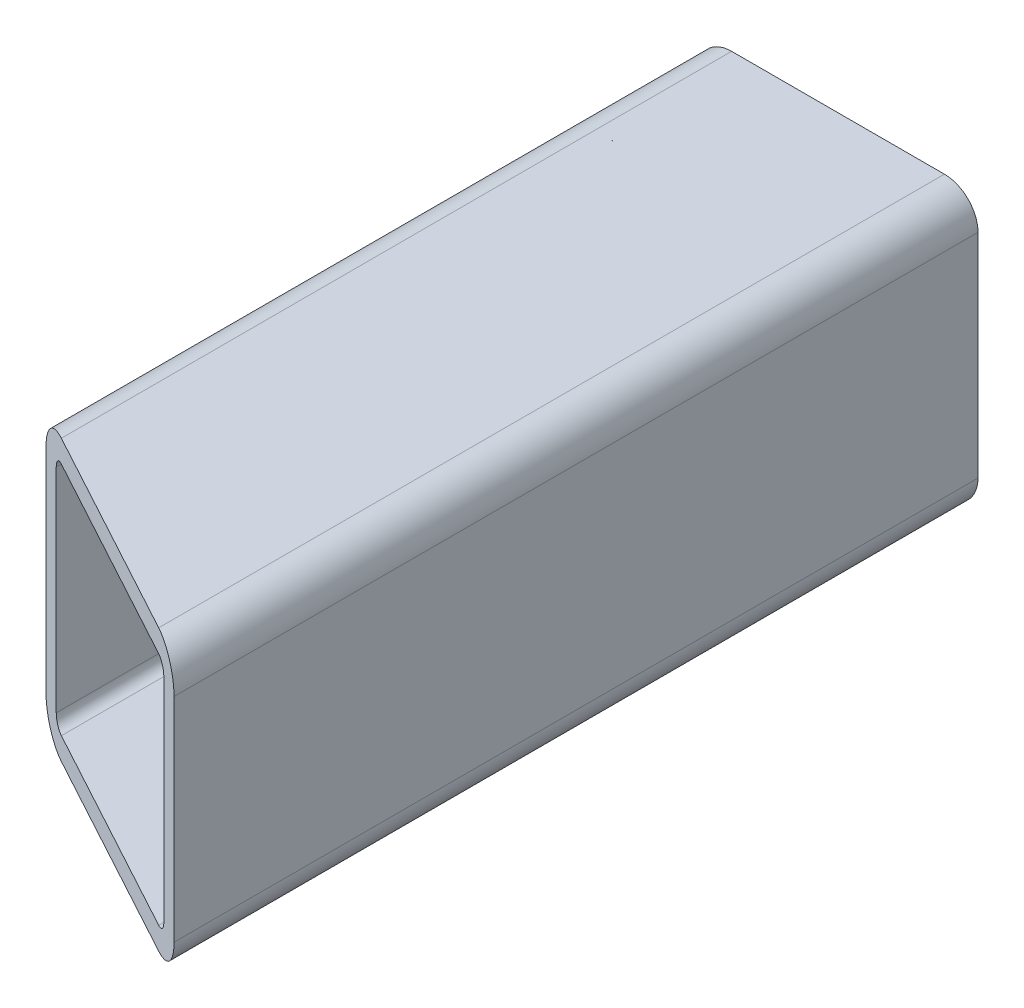
ISO-10303-21;
HEADER;
FILE_DESCRIPTION(('STEP AP214'),'2;1');
FILE_NAME('part.step','',(''),(''),'','','');
FILE_SCHEMA(('AUTOMOTIVE_DESIGN { 1 0 10303 214 1 1 1 1 }'));
ENDSEC;
DATA;
#1=APPLICATION_CONTEXT('core data for automotive mechanical design processes');
#2=APPLICATION_PROTOCOL_DEFINITION('international standard','automotive_design',2000,#1);
#3=PRODUCT_CONTEXT('',#1,'mechanical');
#4=PRODUCT('Part','Part','',(#3));
#5=PRODUCT_RELATED_PRODUCT_CATEGORY('part','',(#4));
#6=PRODUCT_DEFINITION_FORMATION('','',#4);
#7=PRODUCT_DEFINITION_CONTEXT('part definition',#1,'design');
#8=PRODUCT_DEFINITION('design','',#6,#7);
#9=PRODUCT_DEFINITION_SHAPE('','',#8);
#10=(LENGTH_UNIT() NAMED_UNIT(*) SI_UNIT(.MILLI.,.METRE.));
#11=(NAMED_UNIT(*) PLANE_ANGLE_UNIT() SI_UNIT($,.RADIAN.));
#12=(NAMED_UNIT(*) SI_UNIT($,.STERADIAN.) SOLID_ANGLE_UNIT());
#13=UNCERTAINTY_MEASURE_WITH_UNIT(LENGTH_MEASURE(1.E-05),#10,'distance_accuracy_value','');
#14=(GEOMETRIC_REPRESENTATION_CONTEXT(3) GLOBAL_UNCERTAINTY_ASSIGNED_CONTEXT((#13)) GLOBAL_UNIT_ASSIGNED_CONTEXT((#10,
#11,#12)) REPRESENTATION_CONTEXT('',''));
#15=CARTESIAN_POINT('',(0.,0.,0.));
#16=DIRECTION('',(0.,0.,1.));
#17=DIRECTION('',(1.,0.,0.));
#18=AXIS2_PLACEMENT_3D('',#15,#16,#17);
#19=CARTESIAN_POINT('',(0.,0.,0.));
#20=DIRECTION('',(0.,0.,1.));
#21=DIRECTION('',(1.,0.,0.));
#22=AXIS2_PLACEMENT_3D('',#19,#20,#21);
#23=PLANE('',#22);
#24=DIRECTION('',(0.,1.,0.));
#25=VECTOR('',#24,1.);
#26=CARTESIAN_POINT('',(-12.5,-4.75,0.));
#27=LINE('',#26,#25);
#28=CARTESIAN_POINT('',(-12.5,-9.5,0.));
#29=VERTEX_POINT('',#28);
#30=CARTESIAN_POINT('',(-12.5,9.5,0.));
#31=VERTEX_POINT('',#30);
#32=EDGE_CURVE('E11',#29,#31,#27,.T.);
#33=ORIENTED_EDGE('',*,*,#32,.T.);
#34=CARTESIAN_POINT('',(-9.5,9.5,0.));
#35=DIRECTION('',(0.,0.,-1.));
#36=DIRECTION('',(0.,-1.,0.));
#37=AXIS2_PLACEMENT_3D('',#34,#35,#36);
#38=CIRCLE('',#37,3.);
#39=CARTESIAN_POINT('',(-9.5,12.5,0.));
#40=VERTEX_POINT('',#39);
#41=EDGE_CURVE('E245',#31,#40,#38,.T.);
#42=ORIENTED_EDGE('',*,*,#41,.T.);
#43=DIRECTION('',(1.,0.,0.));
#44=VECTOR('',#43,1.);
#45=CARTESIAN_POINT('',(-4.75,12.5,0.));
#46=LINE('',#45,#44);
#47=CARTESIAN_POINT('',(9.5,12.5,0.));
#48=VERTEX_POINT('',#47);
#49=EDGE_CURVE('E162',#40,#48,#46,.T.);
#50=ORIENTED_EDGE('',*,*,#49,.T.);
#51=CARTESIAN_POINT('',(9.5,9.5,0.));
#52=DIRECTION('',(0.,0.,-1.));
#53=DIRECTION('',(-1.,0.,0.));
#54=AXIS2_PLACEMENT_3D('',#51,#52,#53);
#55=CIRCLE('',#54,3.);
#56=CARTESIAN_POINT('',(12.5,9.5,0.));
#57=VERTEX_POINT('',#56);
#58=EDGE_CURVE('E159',#48,#57,#55,.T.);
#59=ORIENTED_EDGE('',*,*,#58,.T.);
#60=DIRECTION('',(0.,-1.,0.));
#61=VECTOR('',#60,1.);
#62=CARTESIAN_POINT('',(12.5,4.75,0.));
#63=LINE('',#62,#61);
#64=CARTESIAN_POINT('',(12.5,-9.5,0.));
#65=VERTEX_POINT('',#64);
#66=EDGE_CURVE('E146',#57,#65,#63,.T.);
#67=ORIENTED_EDGE('',*,*,#66,.T.);
#68=CARTESIAN_POINT('',(9.5,-9.5,0.));
#69=DIRECTION('',(0.,0.,-1.));
#70=DIRECTION('',(0.,1.,0.));
#71=AXIS2_PLACEMENT_3D('',#68,#69,#70);
#72=CIRCLE('',#71,3.);
#73=CARTESIAN_POINT('',(9.5,-12.5,0.));
#74=VERTEX_POINT('',#73);
#75=EDGE_CURVE('E235',#65,#74,#72,.T.);
#76=ORIENTED_EDGE('',*,*,#75,.T.);
#77=DIRECTION('',(-1.,0.,0.));
#78=VECTOR('',#77,1.);
#79=CARTESIAN_POINT('',(4.75,-12.5,0.));
#80=LINE('',#79,#78);
#81=CARTESIAN_POINT('',(-9.5,-12.5,0.));
#82=VERTEX_POINT('',#81);
#83=EDGE_CURVE('E234',#74,#82,#80,.T.);
#84=ORIENTED_EDGE('',*,*,#83,.T.);
#85=CARTESIAN_POINT('',(-9.5,-9.5,0.));
#86=DIRECTION('',(0.,0.,-1.));
#87=DIRECTION('',(1.,0.,0.));
#88=AXIS2_PLACEMENT_3D('',#85,#86,#87);
#89=CIRCLE('',#88,3.);
#90=EDGE_CURVE('E26',#82,#29,#89,.T.);
#91=ORIENTED_EDGE('',*,*,#90,.T.);
#92=EDGE_LOOP('',(#33,#42,#50,#59,#67,#76,#84,#91));
#93=FACE_BOUND('',#92,.T.);
#94=DIRECTION('',(-1.,0.,0.));
#95=VECTOR('',#94,1.);
#96=CARTESIAN_POINT('',(-4.75,10.5,0.));
#97=LINE('',#96,#95);
#98=CARTESIAN_POINT('',(9.5,10.5,0.));
#99=VERTEX_POINT('',#98);
#100=CARTESIAN_POINT('',(-9.5,10.5,0.));
#101=VERTEX_POINT('',#100);
#102=EDGE_CURVE('E187',#99,#101,#97,.T.);
#103=ORIENTED_EDGE('',*,*,#102,.T.);
#104=CARTESIAN_POINT('',(-9.5,9.5,0.));
#105=DIRECTION('',(0.,0.,1.));
#106=DIRECTION('',(0.,-1.,0.));
#107=AXIS2_PLACEMENT_3D('',#104,#105,#106);
#108=CIRCLE('',#107,1.);
#109=CARTESIAN_POINT('',(-10.5,9.5,0.));
#110=VERTEX_POINT('',#109);
#111=EDGE_CURVE('E197',#101,#110,#108,.T.);
#112=ORIENTED_EDGE('',*,*,#111,.T.);
#113=DIRECTION('',(0.,-1.,0.));
#114=VECTOR('',#113,1.);
#115=CARTESIAN_POINT('',(-10.5,-4.75,0.));
#116=LINE('',#115,#114);
#117=CARTESIAN_POINT('',(-10.5,-9.5,0.));
#118=VERTEX_POINT('',#117);
#119=EDGE_CURVE('E288',#110,#118,#116,.T.);
#120=ORIENTED_EDGE('',*,*,#119,.T.);
#121=CARTESIAN_POINT('',(-9.5,-9.5,0.));
#122=DIRECTION('',(0.,0.,1.));
#123=DIRECTION('',(1.,0.,0.));
#124=AXIS2_PLACEMENT_3D('',#121,#122,#123);
#125=CIRCLE('',#124,1.);
#126=CARTESIAN_POINT('',(-9.5,-10.5,0.));
#127=VERTEX_POINT('',#126);
#128=EDGE_CURVE('E277',#118,#127,#125,.T.);
#129=ORIENTED_EDGE('',*,*,#128,.T.);
#130=DIRECTION('',(1.,0.,0.));
#131=VECTOR('',#130,1.);
#132=CARTESIAN_POINT('',(4.75,-10.5,0.));
#133=LINE('',#132,#131);
#134=CARTESIAN_POINT('',(9.5,-10.5,0.));
#135=VERTEX_POINT('',#134);
#136=EDGE_CURVE('E216',#127,#135,#133,.T.);
#137=ORIENTED_EDGE('',*,*,#136,.T.);
#138=CARTESIAN_POINT('',(9.5,-9.5,0.));
#139=DIRECTION('',(0.,0.,1.));
#140=DIRECTION('',(0.,1.,0.));
#141=AXIS2_PLACEMENT_3D('',#138,#139,#140);
#142=CIRCLE('',#141,1.);
#143=CARTESIAN_POINT('',(10.5,-9.5,0.));
#144=VERTEX_POINT('',#143);
#145=EDGE_CURVE('E289',#135,#144,#142,.T.);
#146=ORIENTED_EDGE('',*,*,#145,.T.);
#147=DIRECTION('',(0.,1.,0.));
#148=VECTOR('',#147,1.);
#149=CARTESIAN_POINT('',(10.5,4.75,0.));
#150=LINE('',#149,#148);
#151=CARTESIAN_POINT('',(10.5,9.5,0.));
#152=VERTEX_POINT('',#151);
#153=EDGE_CURVE('E203',#144,#152,#150,.T.);
#154=ORIENTED_EDGE('',*,*,#153,.T.);
#155=CARTESIAN_POINT('',(9.5,9.5,0.));
#156=DIRECTION('',(0.,0.,1.));
#157=DIRECTION('',(-1.,0.,0.));
#158=AXIS2_PLACEMENT_3D('',#155,#156,#157);
#159=CIRCLE('',#158,1.);
#160=EDGE_CURVE('E207',#152,#99,#159,.T.);
#161=ORIENTED_EDGE('',*,*,#160,.T.);
#162=EDGE_LOOP('',(#103,#112,#120,#129,#137,#146,#154,#161));
#163=FACE_BOUND('',#162,.T.);
#164=ADVANCED_FACE('F16',(#93,#163),#23,.F.);
#165=CARTESIAN_POINT('',(-12.5,-9.5,0.));
#166=DIRECTION('',(-1.,0.,0.));
#167=DIRECTION('',(0.,1.,0.));
#168=AXIS2_PLACEMENT_3D('',#165,#166,#167);
#169=PLANE('',#168);
#170=DIRECTION('',(0.,1.,-1.00427515727228E-07));
#171=VECTOR('',#170,1.);
#172=CARTESIAN_POINT('',(-12.5,-4.74999415349802,58.2161367223961));
#173=LINE('',#172,#171);
#174=CARTESIAN_POINT('',(-12.5,-9.5,58.2161371994274));
#175=VERTEX_POINT('',#174);
#176=CARTESIAN_POINT('',(-12.5,9.5,58.2161352913046));
#177=VERTEX_POINT('',#176);
#178=EDGE_CURVE('E239',#175,#177,#173,.T.);
#179=ORIENTED_EDGE('',*,*,#178,.T.);
#180=DIRECTION('',(0.,0.,1.));
#181=VECTOR('',#180,1.);
#182=CARTESIAN_POINT('',(-12.5,9.5,0.));
#183=LINE('',#182,#181);
#184=EDGE_CURVE('E213',#31,#177,#183,.T.);
#185=ORIENTED_EDGE('',*,*,#184,.F.);
#186=ORIENTED_EDGE('',*,*,#32,.F.);
#187=DIRECTION('',(0.,0.,1.));
#188=VECTOR('',#187,1.);
#189=CARTESIAN_POINT('',(-12.5,-9.5,0.));
#190=LINE('',#189,#188);
#191=EDGE_CURVE('E267',#29,#175,#190,.T.);
#192=ORIENTED_EDGE('',*,*,#191,.T.);
#193=EDGE_LOOP('',(#179,#185,#186,#192));
#194=FACE_BOUND('',#193,.T.);
#195=ADVANCED_FACE('F421',(#194),#169,.T.);
#196=CARTESIAN_POINT('',(-9.5,-9.5,0.));
#197=DIRECTION('',(0.,0.,1.));
#198=DIRECTION('',(1.,0.,0.));
#199=AXIS2_PLACEMENT_3D('',#196,#197,#198);
#200=CYLINDRICAL_SURFACE('',#199,3.);
#201=CARTESIAN_POINT('',(-9.5,-9.5,59.8442645005396));
#202=DIRECTION('',(0.476991360566237,-8.82665451376979E-08,-0.878907982638207));
#203=DIRECTION('',(0.87890798263821,0.,0.476991360566239));
#204=AXIS2_PLACEMENT_3D('',#201,#202,#203);
#205=ELLIPSE('',#204,3.41332660444718,3.);
#206=CARTESIAN_POINT('',(-9.5,-12.5,59.8442648018221));
#207=VERTEX_POINT('',#206);
#208=EDGE_CURVE('E242',#207,#175,#205,.T.);
#209=ORIENTED_EDGE('',*,*,#208,.T.);
#210=ORIENTED_EDGE('',*,*,#191,.F.);
#211=ORIENTED_EDGE('',*,*,#90,.F.);
#212=DIRECTION('',(0.,0.,1.));
#213=VECTOR('',#212,1.);
#214=CARTESIAN_POINT('',(-9.5,-12.5,0.));
#215=LINE('',#214,#213);
#216=EDGE_CURVE('E78',#82,#207,#215,.T.);
#217=ORIENTED_EDGE('',*,*,#216,.T.);
#218=EDGE_LOOP('',(#209,#210,#211,#217));
#219=FACE_BOUND('',#218,.T.);
#220=ADVANCED_FACE('F413',(#219),#200,.T.);
#221=CARTESIAN_POINT('',(9.5,-12.5,0.));
#222=DIRECTION('',(0.,-1.,0.));
#223=DIRECTION('',(0.,0.,-1.));
#224=AXIS2_PLACEMENT_3D('',#221,#222,#223);
#225=PLANE('',#224);
#226=DIRECTION('',(-0.87890798263821,0.,-0.476991360566239));
#227=VECTOR('',#226,1.);
#228=CARTESIAN_POINT('',(-23.5807725663636,-12.5,52.202501389806));
#229=LINE('',#228,#227);
#230=CARTESIAN_POINT('',(9.5,-12.5,70.155737708866));
#231=VERTEX_POINT('',#230);
#232=EDGE_CURVE('E251',#231,#207,#229,.T.);
#233=ORIENTED_EDGE('',*,*,#232,.T.);
#234=ORIENTED_EDGE('',*,*,#216,.F.);
#235=ORIENTED_EDGE('',*,*,#83,.F.);
#236=DIRECTION('',(0.,0.,1.));
#237=VECTOR('',#236,1.);
#238=CARTESIAN_POINT('',(9.5,-12.5,0.));
#239=LINE('',#238,#237);
#240=EDGE_CURVE('E89',#74,#231,#239,.T.);
#241=ORIENTED_EDGE('',*,*,#240,.T.);
#242=EDGE_LOOP('',(#233,#234,#235,#241));
#243=FACE_BOUND('',#242,.T.);
#244=ADVANCED_FACE('F411',(#243),#225,.T.);
#245=CARTESIAN_POINT('',(9.5,-9.5,0.));
#246=DIRECTION('',(0.,0.,1.));
#247=DIRECTION('',(0.,1.,0.));
#248=AXIS2_PLACEMENT_3D('',#245,#246,#247);
#249=CYLINDRICAL_SURFACE('',#248,3.);
#250=CARTESIAN_POINT('',(9.5,-9.5,70.1557374075835));
#251=DIRECTION('',(0.476991360566237,-8.82665451376979E-08,-0.878907982638207));
#252=DIRECTION('',(-0.87890798263821,0.,-0.476991360566239));
#253=AXIS2_PLACEMENT_3D('',#250,#251,#252);
#254=ELLIPSE('',#253,3.41332660444718,3.);
#255=CARTESIAN_POINT('',(12.5,-9.5,71.7838654));
#256=VERTEX_POINT('',#255);
#257=EDGE_CURVE('E284',#256,#231,#254,.T.);
#258=ORIENTED_EDGE('',*,*,#257,.T.);
#259=ORIENTED_EDGE('',*,*,#240,.F.);
#260=ORIENTED_EDGE('',*,*,#75,.F.);
#261=DIRECTION('',(0.,0.,1.));
#262=VECTOR('',#261,1.);
#263=CARTESIAN_POINT('',(12.5,-9.5,0.));
#264=LINE('',#263,#262);
#265=EDGE_CURVE('E153',#65,#256,#264,.T.);
#266=ORIENTED_EDGE('',*,*,#265,.T.);
#267=EDGE_LOOP('',(#258,#259,#260,#266));
#268=FACE_BOUND('',#267,.T.);
#269=ADVANCED_FACE('F408',(#268),#249,.T.);
#270=CARTESIAN_POINT('',(12.5,9.5,0.));
#271=DIRECTION('',(1.,0.,0.));
#272=DIRECTION('',(0.,1.,0.));
#273=AXIS2_PLACEMENT_3D('',#270,#271,#272);
#274=PLANE('',#273);
#275=DIRECTION('',(0.,-1.,0.));
#276=VECTOR('',#275,1.);
#277=CARTESIAN_POINT('',(12.5,4.75,71.7838654));
#278=LINE('',#277,#276);
#279=CARTESIAN_POINT('',(12.5,9.5,71.7838654));
#280=VERTEX_POINT('',#279);
#281=EDGE_CURVE('E227',#280,#256,#278,.T.);
#282=ORIENTED_EDGE('',*,*,#281,.T.);
#283=ORIENTED_EDGE('',*,*,#265,.F.);
#284=ORIENTED_EDGE('',*,*,#66,.F.);
#285=DIRECTION('',(0.,0.,1.));
#286=VECTOR('',#285,1.);
#287=CARTESIAN_POINT('',(12.5,9.5,0.));
#288=LINE('',#287,#286);
#289=EDGE_CURVE('E151',#57,#280,#288,.T.);
#290=ORIENTED_EDGE('',*,*,#289,.T.);
#291=EDGE_LOOP('',(#282,#283,#284,#290));
#292=FACE_BOUND('',#291,.T.);
#293=ADVANCED_FACE('F149',(#292),#274,.T.);
#294=CARTESIAN_POINT('',(9.5,9.5,0.));
#295=DIRECTION('',(0.,0.,1.));
#296=DIRECTION('',(-1.,0.,0.));
#297=AXIS2_PLACEMENT_3D('',#294,#295,#296);
#298=CYLINDRICAL_SURFACE('',#297,1.);
#299=CARTESIAN_POINT('',(9.5,9.5,70.1557354994607));
#300=DIRECTION('',(-0.476991360566237,8.82665451376979E-08,0.878907982638207));
#301=DIRECTION('',(-0.87890798263821,0.,-0.476991360566239));
#302=AXIS2_PLACEMENT_3D('',#299,#300,#301);
#303=ELLIPSE('',#302,1.13777553481573,1.);
#304=CARTESIAN_POINT('',(10.5,9.5,70.6984445998314));
#305=VERTEX_POINT('',#304);
#306=CARTESIAN_POINT('',(9.5,10.5,70.1557353990332));
#307=VERTEX_POINT('',#306);
#308=EDGE_CURVE('E221',#305,#307,#303,.T.);
#309=ORIENTED_EDGE('',*,*,#308,.T.);
#310=DIRECTION('',(0.,0.,1.));
#311=VECTOR('',#310,1.);
#312=CARTESIAN_POINT('',(9.5,10.5,0.));
#313=LINE('',#312,#311);
#314=EDGE_CURVE('E191',#99,#307,#313,.T.);
#315=ORIENTED_EDGE('',*,*,#314,.F.);
#316=ORIENTED_EDGE('',*,*,#160,.F.);
#317=DIRECTION('',(0.,0.,1.));
#318=VECTOR('',#317,1.);
#319=CARTESIAN_POINT('',(10.5,9.5,0.));
#320=LINE('',#319,#318);
#321=EDGE_CURVE('E208',#152,#305,#320,.T.);
#322=ORIENTED_EDGE('',*,*,#321,.T.);
#323=EDGE_LOOP('',(#309,#315,#316,#322));
#324=FACE_BOUND('',#323,.T.);
#325=ADVANCED_FACE('F357',(#324),#298,.F.);
#326=CARTESIAN_POINT('',(10.5,9.5,0.));
#327=DIRECTION('',(1.,0.,0.));
#328=DIRECTION('',(0.,-1.,0.));
#329=AXIS2_PLACEMENT_3D('',#326,#327,#328);
#330=PLANE('',#329);
#331=DIRECTION('',(0.,1.,-1.00427515536956E-07));
#332=VECTOR('',#331,1.);
#333=CARTESIAN_POINT('',(10.5,4.75000710006919,70.6984450768614));
#334=LINE('',#333,#332);
#335=CARTESIAN_POINT('',(10.5,-9.5,70.6984465079542));
#336=VERTEX_POINT('',#335);
#337=EDGE_CURVE('E228',#336,#305,#334,.T.);
#338=ORIENTED_EDGE('',*,*,#337,.T.);
#339=ORIENTED_EDGE('',*,*,#321,.F.);
#340=ORIENTED_EDGE('',*,*,#153,.F.);
#341=DIRECTION('',(0.,0.,1.));
#342=VECTOR('',#341,1.);
#343=CARTESIAN_POINT('',(10.5,-9.5,0.));
#344=LINE('',#343,#342);
#345=EDGE_CURVE('E261',#144,#336,#344,.T.);
#346=ORIENTED_EDGE('',*,*,#345,.T.);
#347=EDGE_LOOP('',(#338,#339,#340,#346));
#348=FACE_BOUND('',#347,.T.);
#349=ADVANCED_FACE('F364',(#348),#330,.F.);
#350=CARTESIAN_POINT('',(9.5,-9.5,0.));
#351=DIRECTION('',(0.,0.,1.));
#352=DIRECTION('',(0.,1.,0.));
#353=AXIS2_PLACEMENT_3D('',#350,#351,#352);
#354=CYLINDRICAL_SURFACE('',#353,1.);
#355=CARTESIAN_POINT('',(9.5,-9.5,70.1557374075835));
#356=DIRECTION('',(-0.476991360566237,8.82665451376979E-08,0.878907982638207));
#357=DIRECTION('',(-0.87890798263821,0.,-0.476991360566239));
#358=AXIS2_PLACEMENT_3D('',#355,#356,#357);
#359=ELLIPSE('',#358,1.13777553481573,1.);
#360=CARTESIAN_POINT('',(9.5,-10.5,70.155737508011));
#361=VERTEX_POINT('',#360);
#362=EDGE_CURVE('E223',#361,#336,#359,.T.);
#363=ORIENTED_EDGE('',*,*,#362,.T.);
#364=ORIENTED_EDGE('',*,*,#345,.F.);
#365=ORIENTED_EDGE('',*,*,#145,.F.);
#366=DIRECTION('',(0.,0.,1.));
#367=VECTOR('',#366,1.);
#368=CARTESIAN_POINT('',(9.5,-10.5,0.));
#369=LINE('',#368,#367);
#370=EDGE_CURVE('E167',#135,#361,#369,.T.);
#371=ORIENTED_EDGE('',*,*,#370,.T.);
#372=EDGE_LOOP('',(#363,#364,#365,#371));
#373=FACE_BOUND('',#372,.T.);
#374=ADVANCED_FACE('F394',(#373),#354,.F.);
#375=CARTESIAN_POINT('',(9.5,-10.5,0.));
#376=DIRECTION('',(0.,-1.,0.));
#377=DIRECTION('',(0.,0.,-1.));
#378=AXIS2_PLACEMENT_3D('',#375,#376,#377);
#379=PLANE('',#378);
#380=DIRECTION('',(0.87890798263821,0.,0.476991360566239));
#381=VECTOR('',#380,1.);
#382=CARTESIAN_POINT('',(-23.5807724821588,-10.5,52.2025012346497));
#383=LINE('',#382,#381);
#384=CARTESIAN_POINT('',(-9.5,-10.5,59.8442646009671));
#385=VERTEX_POINT('',#384);
#386=EDGE_CURVE('E182',#385,#361,#383,.T.);
#387=ORIENTED_EDGE('',*,*,#386,.T.);
#388=ORIENTED_EDGE('',*,*,#370,.F.);
#389=ORIENTED_EDGE('',*,*,#136,.F.);
#390=DIRECTION('',(0.,0.,1.));
#391=VECTOR('',#390,1.);
#392=CARTESIAN_POINT('',(-9.5,-10.5,0.));
#393=LINE('',#392,#391);
#394=EDGE_CURVE('E281',#127,#385,#393,.T.);
#395=ORIENTED_EDGE('',*,*,#394,.T.);
#396=EDGE_LOOP('',(#387,#388,#389,#395));
#397=FACE_BOUND('',#396,.T.);
#398=ADVANCED_FACE('F392',(#397),#379,.F.);
#399=CARTESIAN_POINT('',(9.5,9.5,0.));
#400=DIRECTION('',(0.,0.,1.));
#401=DIRECTION('',(-1.,0.,0.));
#402=AXIS2_PLACEMENT_3D('',#399,#400,#401);
#403=CYLINDRICAL_SURFACE('',#402,3.);
#404=CARTESIAN_POINT('',(9.5,9.5,70.1557354994607));
#405=DIRECTION('',(0.476991360566237,-8.82665451376979E-08,-0.878907982638207));
#406=DIRECTION('',(-0.87890798263821,0.,-0.476991360566239));
#407=AXIS2_PLACEMENT_3D('',#404,#405,#406);
#408=ELLIPSE('',#407,3.41332660444718,3.);
#409=CARTESIAN_POINT('',(9.5,12.5,70.1557351981781));
#410=VERTEX_POINT('',#409);
#411=EDGE_CURVE('E170',#410,#280,#408,.T.);
#412=ORIENTED_EDGE('',*,*,#411,.T.);
#413=ORIENTED_EDGE('',*,*,#289,.F.);
#414=ORIENTED_EDGE('',*,*,#58,.F.);
#415=DIRECTION('',(0.,0.,1.));
#416=VECTOR('',#415,1.);
#417=CARTESIAN_POINT('',(9.5,12.5,0.));
#418=LINE('',#417,#416);
#419=EDGE_CURVE('E178',#48,#410,#418,.T.);
#420=ORIENTED_EDGE('',*,*,#419,.T.);
#421=EDGE_LOOP('',(#412,#413,#414,#420));
#422=FACE_BOUND('',#421,.T.);
#423=ADVANCED_FACE('F18',(#422),#403,.T.);
#424=CARTESIAN_POINT('',(-9.5,12.5,0.));
#425=DIRECTION('',(0.,1.,0.));
#426=DIRECTION('',(1.,0.,0.));
#427=AXIS2_PLACEMENT_3D('',#424,#425,#426);
#428=PLANE('',#427);
#429=DIRECTION('',(0.87890798263821,0.,0.476991360566239));
#430=VECTOR('',#429,1.);
#431=CARTESIAN_POINT('',(-30.9193243122832,12.5,48.219800063066));
#432=LINE('',#431,#430);
#433=CARTESIAN_POINT('',(-9.5,12.5,59.8442622911342));
#434=VERTEX_POINT('',#433);
#435=EDGE_CURVE('E238',#434,#410,#432,.T.);
#436=ORIENTED_EDGE('',*,*,#435,.T.);
#437=ORIENTED_EDGE('',*,*,#419,.F.);
#438=ORIENTED_EDGE('',*,*,#49,.F.);
#439=DIRECTION('',(0.,0.,1.));
#440=VECTOR('',#439,1.);
#441=CARTESIAN_POINT('',(-9.5,12.5,0.));
#442=LINE('',#441,#440);
#443=EDGE_CURVE('E248',#40,#434,#442,.T.);
#444=ORIENTED_EDGE('',*,*,#443,.T.);
#445=EDGE_LOOP('',(#436,#437,#438,#444));
#446=FACE_BOUND('',#445,.T.);
#447=ADVANCED_FACE('F327',(#446),#428,.T.);
#448=CARTESIAN_POINT('',(-9.5,9.5,0.));
#449=DIRECTION('',(0.,0.,1.));
#450=DIRECTION('',(0.,-1.,0.));
#451=AXIS2_PLACEMENT_3D('',#448,#449,#450);
#452=CYLINDRICAL_SURFACE('',#451,3.);
#453=CARTESIAN_POINT('',(-9.5,9.5,59.8442625924168));
#454=DIRECTION('',(0.476991360566237,-8.82665451376979E-08,-0.878907982638207));
#455=DIRECTION('',(0.87890798263821,0.,0.476991360566239));
#456=AXIS2_PLACEMENT_3D('',#453,#454,#455);
#457=ELLIPSE('',#456,3.41332660444718,3.);
#458=EDGE_CURVE('E243',#177,#434,#457,.T.);
#459=ORIENTED_EDGE('',*,*,#458,.T.);
#460=ORIENTED_EDGE('',*,*,#443,.F.);
#461=ORIENTED_EDGE('',*,*,#41,.F.);
#462=ORIENTED_EDGE('',*,*,#184,.T.);
#463=EDGE_LOOP('',(#459,#460,#461,#462));
#464=FACE_BOUND('',#463,.T.);
#465=ADVANCED_FACE('F332',(#464),#452,.T.);
#466=CARTESIAN_POINT('',(-9.5,-9.5,0.));
#467=DIRECTION('',(0.,0.,1.));
#468=DIRECTION('',(1.,0.,0.));
#469=AXIS2_PLACEMENT_3D('',#466,#467,#468);
#470=CYLINDRICAL_SURFACE('',#469,1.);
#471=CARTESIAN_POINT('',(-9.5,-9.5,59.8442645005396));
#472=DIRECTION('',(-0.476991360566237,8.82665451376979E-08,0.878907982638207));
#473=DIRECTION('',(0.87890798263821,0.,0.476991360566239));
#474=AXIS2_PLACEMENT_3D('',#471,#472,#473);
#475=ELLIPSE('',#474,1.13777553481573,1.);
#476=CARTESIAN_POINT('',(-10.5,-9.5,59.3015554001688));
#477=VERTEX_POINT('',#476);
#478=EDGE_CURVE('E186',#477,#385,#475,.T.);
#479=ORIENTED_EDGE('',*,*,#478,.T.);
#480=ORIENTED_EDGE('',*,*,#394,.F.);
#481=ORIENTED_EDGE('',*,*,#128,.F.);
#482=DIRECTION('',(0.,0.,1.));
#483=VECTOR('',#482,1.);
#484=CARTESIAN_POINT('',(-10.5,-9.5,0.));
#485=LINE('',#484,#483);
#486=EDGE_CURVE('E201',#118,#477,#485,.T.);
#487=ORIENTED_EDGE('',*,*,#486,.T.);
#488=EDGE_LOOP('',(#479,#480,#481,#487));
#489=FACE_BOUND('',#488,.T.);
#490=ADVANCED_FACE('F386',(#489),#470,.F.);
#491=CARTESIAN_POINT('',(-10.5,-9.5,0.));
#492=DIRECTION('',(-1.,0.,0.));
#493=DIRECTION('',(0.,0.,1.));
#494=AXIS2_PLACEMENT_3D('',#491,#492,#493);
#495=PLANE('',#494);
#496=DIRECTION('',(0.,-1.,1.0042751560038E-07));
#497=VECTOR('',#496,1.);
#498=CARTESIAN_POINT('',(-10.5,-4.74999404449217,59.3015549231375));
#499=LINE('',#498,#497);
#500=CARTESIAN_POINT('',(-10.5,9.5,59.301553492046));
#501=VERTEX_POINT('',#500);
#502=EDGE_CURVE('E196',#501,#477,#499,.T.);
#503=ORIENTED_EDGE('',*,*,#502,.T.);
#504=ORIENTED_EDGE('',*,*,#486,.F.);
#505=ORIENTED_EDGE('',*,*,#119,.F.);
#506=DIRECTION('',(0.,0.,1.));
#507=VECTOR('',#506,1.);
#508=CARTESIAN_POINT('',(-10.5,9.5,0.));
#509=LINE('',#508,#507);
#510=EDGE_CURVE('E202',#110,#501,#509,.T.);
#511=ORIENTED_EDGE('',*,*,#510,.T.);
#512=EDGE_LOOP('',(#503,#504,#505,#511));
#513=FACE_BOUND('',#512,.T.);
#514=ADVANCED_FACE('F383',(#513),#495,.F.);
#515=CARTESIAN_POINT('',(-9.5,9.5,0.));
#516=DIRECTION('',(0.,0.,1.));
#517=DIRECTION('',(0.,-1.,0.));
#518=AXIS2_PLACEMENT_3D('',#515,#516,#517);
#519=CYLINDRICAL_SURFACE('',#518,1.);
#520=CARTESIAN_POINT('',(-9.5,9.5,59.8442625924168));
#521=DIRECTION('',(-0.476991360566237,8.82665451376979E-08,0.878907982638207));
#522=DIRECTION('',(0.87890798263821,0.,0.476991360566239));
#523=AXIS2_PLACEMENT_3D('',#520,#521,#522);
#524=ELLIPSE('',#523,1.13777553481573,1.);
#525=CARTESIAN_POINT('',(-9.5,10.5,59.8442624919892));
#526=VERTEX_POINT('',#525);
#527=EDGE_CURVE('E222',#526,#501,#524,.T.);
#528=ORIENTED_EDGE('',*,*,#527,.T.);
#529=ORIENTED_EDGE('',*,*,#510,.F.);
#530=ORIENTED_EDGE('',*,*,#111,.F.);
#531=DIRECTION('',(0.,0.,1.));
#532=VECTOR('',#531,1.);
#533=CARTESIAN_POINT('',(-9.5,10.5,0.));
#534=LINE('',#533,#532);
#535=EDGE_CURVE('E192',#101,#526,#534,.T.);
#536=ORIENTED_EDGE('',*,*,#535,.T.);
#537=EDGE_LOOP('',(#528,#529,#530,#536));
#538=FACE_BOUND('',#537,.T.);
#539=ADVANCED_FACE('F380',(#538),#519,.F.);
#540=CARTESIAN_POINT('',(-9.5,10.5,0.));
#541=DIRECTION('',(0.,1.,0.));
#542=DIRECTION('',(1.,0.,0.));
#543=AXIS2_PLACEMENT_3D('',#540,#541,#542);
#544=PLANE('',#543);
#545=DIRECTION('',(-0.87890798263821,0.,-0.476991360566239));
#546=VECTOR('',#545,1.);
#547=CARTESIAN_POINT('',(-30.9193243964879,10.5,48.2198002182224));
#548=LINE('',#547,#546);
#549=EDGE_CURVE('E217',#307,#526,#548,.T.);
#550=ORIENTED_EDGE('',*,*,#549,.T.);
#551=ORIENTED_EDGE('',*,*,#535,.F.);
#552=ORIENTED_EDGE('',*,*,#102,.F.);
#553=ORIENTED_EDGE('',*,*,#314,.T.);
#554=EDGE_LOOP('',(#550,#551,#552,#553));
#555=FACE_BOUND('',#554,.T.);
#556=ADVANCED_FACE('F374',(#555),#544,.F.);
#557=CARTESIAN_POINT('',(-27.2500484393232,5.0425811228922E-06,50.2111507264357));
#558=DIRECTION('',(0.476991360566237,-8.82665451376979E-08,-0.878907982638207));
#559=DIRECTION('',(0.,-1.,1.0042751560038E-07));
#560=AXIS2_PLACEMENT_3D('',#557,#558,#559);
#561=PLANE('',#560);
#562=ORIENTED_EDGE('',*,*,#281,.F.);
#563=ORIENTED_EDGE('',*,*,#411,.F.);
#564=ORIENTED_EDGE('',*,*,#435,.F.);
#565=ORIENTED_EDGE('',*,*,#458,.F.);
#566=ORIENTED_EDGE('',*,*,#178,.F.);
#567=ORIENTED_EDGE('',*,*,#208,.F.);
#568=ORIENTED_EDGE('',*,*,#232,.F.);
#569=ORIENTED_EDGE('',*,*,#257,.F.);
#570=EDGE_LOOP('',(#562,#563,#564,#565,#566,#567,#568,#569));
#571=FACE_BOUND('',#570,.T.);
#572=ORIENTED_EDGE('',*,*,#386,.F.);
#573=ORIENTED_EDGE('',*,*,#478,.F.);
#574=ORIENTED_EDGE('',*,*,#502,.F.);
#575=ORIENTED_EDGE('',*,*,#527,.F.);
#576=ORIENTED_EDGE('',*,*,#549,.F.);
#577=ORIENTED_EDGE('',*,*,#308,.F.);
#578=ORIENTED_EDGE('',*,*,#337,.F.);
#579=ORIENTED_EDGE('',*,*,#362,.F.);
#580=EDGE_LOOP('',(#572,#573,#574,#575,#576,#577,#578,#579));
#581=FACE_BOUND('',#580,.T.);
#582=ADVANCED_FACE('F335',(#571,#581),#561,.F.);
#583=CLOSED_SHELL('',(#164,#195,#220,#244,#269,#293,#325,#349,#374,#398,#423,#447,#465,#490,
#514,#539,#556,#582));
#584=MANIFOLD_SOLID_BREP('B1',#583);
#585=ADVANCED_BREP_SHAPE_REPRESENTATION('',(#18,#584),#14);
#586=SHAPE_DEFINITION_REPRESENTATION(#9,#585);
ENDSEC;
END-ISO-10303-21;
